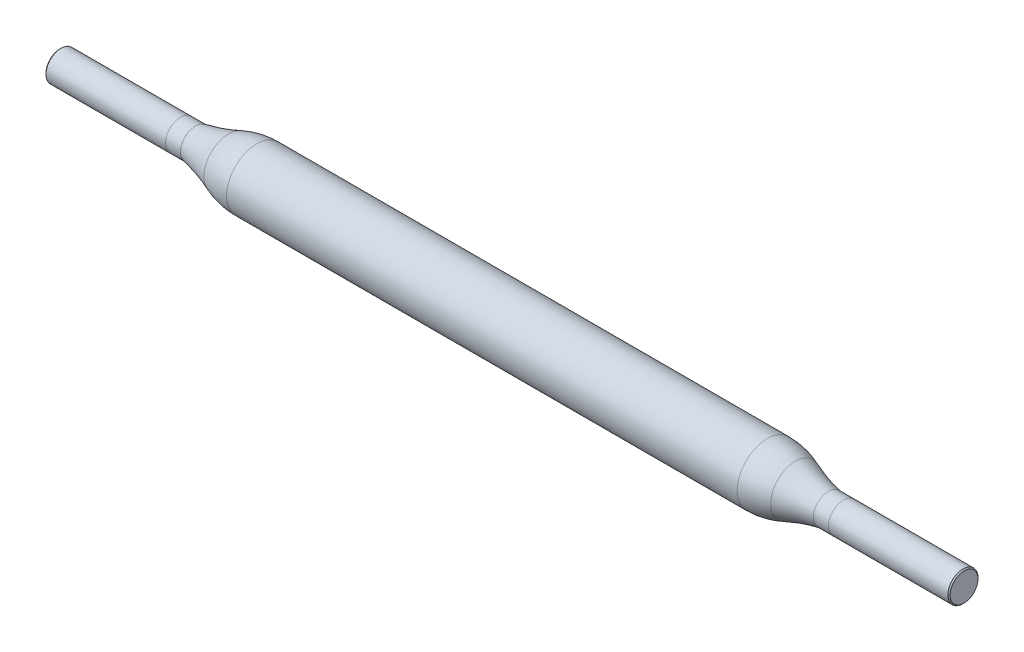
ISO-10303-21;
HEADER;
FILE_DESCRIPTION(('STEP AP214'),'2;1');
FILE_NAME('part.step','',(''),(''),'','','');
FILE_SCHEMA(('AUTOMOTIVE_DESIGN { 1 0 10303 214 1 1 1 1 }'));
ENDSEC;
DATA;
#1=APPLICATION_CONTEXT('core data for automotive mechanical design processes');
#2=APPLICATION_PROTOCOL_DEFINITION('international standard','automotive_design',2000,#1);
#3=PRODUCT_CONTEXT('',#1,'mechanical');
#4=PRODUCT('Part','Part','',(#3));
#5=PRODUCT_RELATED_PRODUCT_CATEGORY('part','',(#4));
#6=PRODUCT_DEFINITION_FORMATION('','',#4);
#7=PRODUCT_DEFINITION_CONTEXT('part definition',#1,'design');
#8=PRODUCT_DEFINITION('design','',#6,#7);
#9=PRODUCT_DEFINITION_SHAPE('','',#8);
#10=(LENGTH_UNIT() NAMED_UNIT(*) SI_UNIT(.MILLI.,.METRE.));
#11=(NAMED_UNIT(*) PLANE_ANGLE_UNIT() SI_UNIT($,.RADIAN.));
#12=(NAMED_UNIT(*) SI_UNIT($,.STERADIAN.) SOLID_ANGLE_UNIT());
#13=UNCERTAINTY_MEASURE_WITH_UNIT(LENGTH_MEASURE(1.E-05),#10,'distance_accuracy_value','');
#14=(GEOMETRIC_REPRESENTATION_CONTEXT(3) GLOBAL_UNCERTAINTY_ASSIGNED_CONTEXT((#13)) GLOBAL_UNIT_ASSIGNED_CONTEXT((#10,
#11,#12)) REPRESENTATION_CONTEXT('',''));
#15=CARTESIAN_POINT('',(0.,0.,0.));
#16=DIRECTION('',(0.,0.,1.));
#17=DIRECTION('',(1.,0.,0.));
#18=AXIS2_PLACEMENT_3D('',#15,#16,#17);
#19=CARTESIAN_POINT('',(-30.,0.,0.));
#20=DIRECTION('',(-1.,0.,0.));
#21=DIRECTION('',(0.,-1.,0.));
#22=AXIS2_PLACEMENT_3D('',#19,#20,#21);
#23=CYLINDRICAL_SURFACE('',#22,1.);
#24=CARTESIAN_POINT('',(21.,0.,0.));
#25=DIRECTION('',(-1.,0.,0.));
#26=DIRECTION('',(0.,-1.,0.));
#27=AXIS2_PLACEMENT_3D('',#24,#25,#26);
#28=CIRCLE('',#27,0.999999999999999);
#29=CARTESIAN_POINT('',(21.,-0.99999999999999,0.));
#30=VERTEX_POINT('',#29);
#31=EDGE_CURVE('E66',#30,#30,#28,.T.);
#32=ORIENTED_EDGE('',*,*,#31,.F.);
#33=EDGE_LOOP('',(#32));
#34=FACE_BOUND('',#33,.T.);
#35=CARTESIAN_POINT('',(22.,0.,0.));
#36=DIRECTION('',(1.,0.,0.));
#37=DIRECTION('',(0.,0.,-1.));
#38=AXIS2_PLACEMENT_3D('',#35,#36,#37);
#39=CIRCLE('',#38,1.);
#40=CARTESIAN_POINT('',(22.,0.,-1.));
#41=VERTEX_POINT('',#40);
#42=EDGE_CURVE('E58',#41,#41,#39,.T.);
#43=ORIENTED_EDGE('',*,*,#42,.F.);
#44=EDGE_LOOP('',(#43));
#45=FACE_BOUND('',#44,.T.);
#46=ADVANCED_FACE('F38',(#34,#45),#23,.T.);
#47=CARTESIAN_POINT('',(-30.,0.,0.));
#48=DIRECTION('',(-1.,0.,0.));
#49=DIRECTION('',(0.,-1.,0.));
#50=AXIS2_PLACEMENT_3D('',#47,#48,#49);
#51=CYLINDRICAL_SURFACE('',#50,1.);
#52=CARTESIAN_POINT('',(-29.925,0.,0.));
#53=DIRECTION('',(1.,0.,0.));
#54=DIRECTION('',(0.,1.,0.));
#55=AXIS2_PLACEMENT_3D('',#52,#53,#54);
#56=CIRCLE('',#55,1.);
#57=CARTESIAN_POINT('',(-29.925,1.,0.));
#58=VERTEX_POINT('',#57);
#59=EDGE_CURVE('E49',#58,#58,#56,.T.);
#60=ORIENTED_EDGE('',*,*,#59,.T.);
#61=EDGE_LOOP('',(#60));
#62=FACE_BOUND('',#61,.T.);
#63=CARTESIAN_POINT('',(-22.,0.,0.));
#64=DIRECTION('',(1.,0.,0.));
#65=DIRECTION('',(0.,0.,-1.));
#66=AXIS2_PLACEMENT_3D('',#63,#64,#65);
#67=CIRCLE('',#66,1.);
#68=CARTESIAN_POINT('',(-22.,0.,-1.));
#69=VERTEX_POINT('',#68);
#70=EDGE_CURVE('E62',#69,#69,#67,.T.);
#71=ORIENTED_EDGE('',*,*,#70,.F.);
#72=EDGE_LOOP('',(#71));
#73=FACE_BOUND('',#72,.T.);
#74=ADVANCED_FACE('F120',(#62,#73),#51,.T.);
#75=CARTESIAN_POINT('',(-30.,0.,0.));
#76=DIRECTION('',(1.,0.,0.));
#77=DIRECTION('',(0.,1.,0.));
#78=AXIS2_PLACEMENT_3D('',#75,#76,#77);
#79=PLANE('',#78);
#80=CARTESIAN_POINT('',(-30.,0.,0.));
#81=DIRECTION('',(1.,0.,0.));
#82=DIRECTION('',(0.,1.,0.));
#83=AXIS2_PLACEMENT_3D('',#80,#81,#82);
#84=CIRCLE('',#83,0.924999999999995);
#85=CARTESIAN_POINT('',(-30.,0.924999999999995,0.));
#86=VERTEX_POINT('',#85);
#87=EDGE_CURVE('E53',#86,#86,#84,.F.);
#88=ORIENTED_EDGE('',*,*,#87,.T.);
#89=EDGE_LOOP('',(#88));
#90=FACE_BOUND('',#89,.T.);
#91=ADVANCED_FACE('F129',(#90),#79,.F.);
#92=CARTESIAN_POINT('',(30.,0.,0.));
#93=DIRECTION('',(-1.,0.,0.));
#94=DIRECTION('',(0.,-1.,0.));
#95=AXIS2_PLACEMENT_3D('',#92,#93,#94);
#96=PLANE('',#95);
#97=CARTESIAN_POINT('',(30.,0.,0.));
#98=DIRECTION('',(-1.,0.,0.));
#99=DIRECTION('',(0.,-1.,0.));
#100=AXIS2_PLACEMENT_3D('',#97,#98,#99);
#101=CIRCLE('',#100,0.925000000000009);
#102=CARTESIAN_POINT('',(30.,-0.924999999999998,0.));
#103=VERTEX_POINT('',#102);
#104=EDGE_CURVE('E10',#103,#103,#101,.F.);
#105=ORIENTED_EDGE('',*,*,#104,.T.);
#106=EDGE_LOOP('',(#105));
#107=FACE_BOUND('',#106,.T.);
#108=ADVANCED_FACE('F125',(#107),#96,.F.);
#109=CARTESIAN_POINT('',(29.925,0.,0.));
#110=DIRECTION('',(-1.,0.,0.));
#111=DIRECTION('',(0.,-1.,0.));
#112=AXIS2_PLACEMENT_3D('',#109,#110,#111);
#113=CIRCLE('',#112,1.);
#114=CARTESIAN_POINT('',(29.925,-0.999999999999989,0.));
#115=VERTEX_POINT('',#114);
#116=EDGE_CURVE('E45',#115,#115,#113,.T.);
#117=ORIENTED_EDGE('',*,*,#116,.T.);
#118=EDGE_LOOP('',(#117));
#119=FACE_BOUND('',#118,.T.);
#120=ORIENTED_EDGE('',*,*,#42,.T.);
#121=EDGE_LOOP('',(#120));
#122=FACE_BOUND('',#121,.T.);
#123=ADVANCED_FACE('F114',(#119,#122),#23,.T.);
#124=CARTESIAN_POINT('',(23.1066464812467,0.,0.));
#125=DIRECTION('',(-1.,0.,0.));
#126=DIRECTION('',(0.,-1.,0.));
#127=AXIS2_PLACEMENT_3D('',#124,#125,#126);
#128=TOROIDAL_SURFACE('',#127,12.3199394437402,11.5142949591755);
#129=CARTESIAN_POINT('',(18.8074100636018,0.,0.));
#130=DIRECTION('',(-1.,0.,0.));
#131=DIRECTION('',(0.,-1.,0.));
#132=AXIS2_PLACEMENT_3D('',#129,#130,#131);
#133=CIRCLE('',#132,1.63838737336718);
#134=CARTESIAN_POINT('',(18.8074100636018,-1.63838737336717,0.));
#135=VERTEX_POINT('',#134);
#136=EDGE_CURVE('E69',#135,#135,#133,.T.);
#137=ORIENTED_EDGE('',*,*,#136,.F.);
#138=EDGE_LOOP('',(#137));
#139=FACE_BOUND('',#138,.T.);
#140=ORIENTED_EDGE('',*,*,#31,.T.);
#141=EDGE_LOOP('',(#140));
#142=FACE_BOUND('',#141,.T.);
#143=ADVANCED_FACE('F108',(#139,#142),#128,.F.);
#144=CARTESIAN_POINT('',(16.9404974854161,0.,0.));
#145=DIRECTION('',(-1.,0.,0.));
#146=DIRECTION('',(0.,-1.,0.));
#147=AXIS2_PLACEMENT_3D('',#144,#145,#146);
#148=DEGENERATE_TOROIDAL_SURFACE('',#147,3.00000000000001,5.,.F.);
#149=CARTESIAN_POINT('',(16.9404974854161,0.,0.));
#150=DIRECTION('',(-1.,0.,0.));
#151=DIRECTION('',(0.,-1.,0.));
#152=AXIS2_PLACEMENT_3D('',#149,#150,#151);
#153=CIRCLE('',#152,1.99999999999999);
#154=CARTESIAN_POINT('',(16.9404974854161,-1.99999999999998,0.));
#155=VERTEX_POINT('',#154);
#156=EDGE_CURVE('E72',#155,#155,#153,.T.);
#157=ORIENTED_EDGE('',*,*,#156,.F.);
#158=EDGE_LOOP('',(#157));
#159=FACE_BOUND('',#158,.T.);
#160=ORIENTED_EDGE('',*,*,#136,.T.);
#161=EDGE_LOOP('',(#160));
#162=FACE_BOUND('',#161,.T.);
#163=ADVANCED_FACE('F102',(#159,#162),#148,.F.);
#164=CARTESIAN_POINT('',(-30.,0.,0.));
#165=DIRECTION('',(-1.,0.,0.));
#166=DIRECTION('',(0.,-1.,0.));
#167=AXIS2_PLACEMENT_3D('',#164,#165,#166);
#168=CYLINDRICAL_SURFACE('',#167,1.99999999999999);
#169=CARTESIAN_POINT('',(-16.9404974854161,0.,0.));
#170=DIRECTION('',(-1.,0.,0.));
#171=DIRECTION('',(0.,-1.,0.));
#172=AXIS2_PLACEMENT_3D('',#169,#170,#171);
#173=CIRCLE('',#172,2.);
#174=CARTESIAN_POINT('',(-16.9404974854161,-2.,0.));
#175=VERTEX_POINT('',#174);
#176=EDGE_CURVE('E75',#175,#175,#173,.T.);
#177=ORIENTED_EDGE('',*,*,#176,.F.);
#178=EDGE_LOOP('',(#177));
#179=FACE_BOUND('',#178,.T.);
#180=ORIENTED_EDGE('',*,*,#156,.T.);
#181=EDGE_LOOP('',(#180));
#182=FACE_BOUND('',#181,.T.);
#183=ADVANCED_FACE('F96',(#179,#182),#168,.T.);
#184=CARTESIAN_POINT('',(-16.9404974854161,0.,0.));
#185=DIRECTION('',(-1.,0.,0.));
#186=DIRECTION('',(0.,-1.,0.));
#187=AXIS2_PLACEMENT_3D('',#184,#185,#186);
#188=DEGENERATE_TOROIDAL_SURFACE('',#187,3.,5.,.F.);
#189=CARTESIAN_POINT('',(-18.8074100636018,0.,0.));
#190=DIRECTION('',(-1.,0.,0.));
#191=DIRECTION('',(0.,-1.,0.));
#192=AXIS2_PLACEMENT_3D('',#189,#190,#191);
#193=CIRCLE('',#192,1.63838737336718);
#194=CARTESIAN_POINT('',(-18.8074100636018,-1.63838737336718,0.));
#195=VERTEX_POINT('',#194);
#196=EDGE_CURVE('E78',#195,#195,#193,.T.);
#197=ORIENTED_EDGE('',*,*,#196,.F.);
#198=EDGE_LOOP('',(#197));
#199=FACE_BOUND('',#198,.T.);
#200=ORIENTED_EDGE('',*,*,#176,.T.);
#201=EDGE_LOOP('',(#200));
#202=FACE_BOUND('',#201,.T.);
#203=ADVANCED_FACE('F90',(#199,#202),#188,.F.);
#204=CARTESIAN_POINT('',(-23.1066464812467,0.,0.));
#205=DIRECTION('',(-1.,0.,0.));
#206=DIRECTION('',(0.,-1.,0.));
#207=AXIS2_PLACEMENT_3D('',#204,#205,#206);
#208=TOROIDAL_SURFACE('',#207,12.3199394437402,11.5142949591755);
#209=CARTESIAN_POINT('',(-21.,0.,0.));
#210=DIRECTION('',(-1.,0.,0.));
#211=DIRECTION('',(0.,-1.,0.));
#212=AXIS2_PLACEMENT_3D('',#209,#210,#211);
#213=CIRCLE('',#212,0.999999999999999);
#214=CARTESIAN_POINT('',(-21.,-0.999999999999998,0.));
#215=VERTEX_POINT('',#214);
#216=EDGE_CURVE('E81',#215,#215,#213,.T.);
#217=ORIENTED_EDGE('',*,*,#216,.F.);
#218=EDGE_LOOP('',(#217));
#219=FACE_BOUND('',#218,.T.);
#220=ORIENTED_EDGE('',*,*,#196,.T.);
#221=EDGE_LOOP('',(#220));
#222=FACE_BOUND('',#221,.T.);
#223=ADVANCED_FACE('F87',(#219,#222),#208,.F.);
#224=ORIENTED_EDGE('',*,*,#70,.T.);
#225=EDGE_LOOP('',(#224));
#226=FACE_BOUND('',#225,.T.);
#227=ORIENTED_EDGE('',*,*,#216,.T.);
#228=EDGE_LOOP('',(#227));
#229=FACE_BOUND('',#228,.T.);
#230=ADVANCED_FACE('F85',(#226,#229),#51,.T.);
#231=CARTESIAN_POINT('',(-30.,0.,0.));
#232=DIRECTION('',(1.,0.,0.));
#233=DIRECTION('',(0.,1.,0.));
#234=AXIS2_PLACEMENT_3D('',#231,#232,#233);
#235=CONICAL_SURFACE('',#234,0.924999999999995,0.785398163397441);
#236=ORIENTED_EDGE('',*,*,#59,.F.);
#237=EDGE_LOOP('',(#236));
#238=FACE_BOUND('',#237,.T.);
#239=ORIENTED_EDGE('',*,*,#87,.F.);
#240=EDGE_LOOP('',(#239));
#241=FACE_BOUND('',#240,.T.);
#242=ADVANCED_FACE('F134',(#238,#241),#235,.T.);
#243=CARTESIAN_POINT('',(29.925,0.,0.));
#244=DIRECTION('',(-1.,0.,0.));
#245=DIRECTION('',(0.,-1.,0.));
#246=AXIS2_PLACEMENT_3D('',#243,#244,#245);
#247=CONICAL_SURFACE('',#246,1.,0.785398163397442);
#248=ORIENTED_EDGE('',*,*,#104,.F.);
#249=EDGE_LOOP('',(#248));
#250=FACE_BOUND('',#249,.T.);
#251=ORIENTED_EDGE('',*,*,#116,.F.);
#252=EDGE_LOOP('',(#251));
#253=FACE_BOUND('',#252,.T.);
#254=ADVANCED_FACE('F40',(#250,#253),#247,.T.);
#255=CLOSED_SHELL('',(#46,#74,#91,#108,#123,#143,#163,#183,#203,#223,#230,#242,#254));
#256=MANIFOLD_SOLID_BREP('B2',#255);
#257=ADVANCED_BREP_SHAPE_REPRESENTATION('',(#18,#256),#14);
#258=SHAPE_DEFINITION_REPRESENTATION(#9,#257);
ENDSEC;
END-ISO-10303-21;
